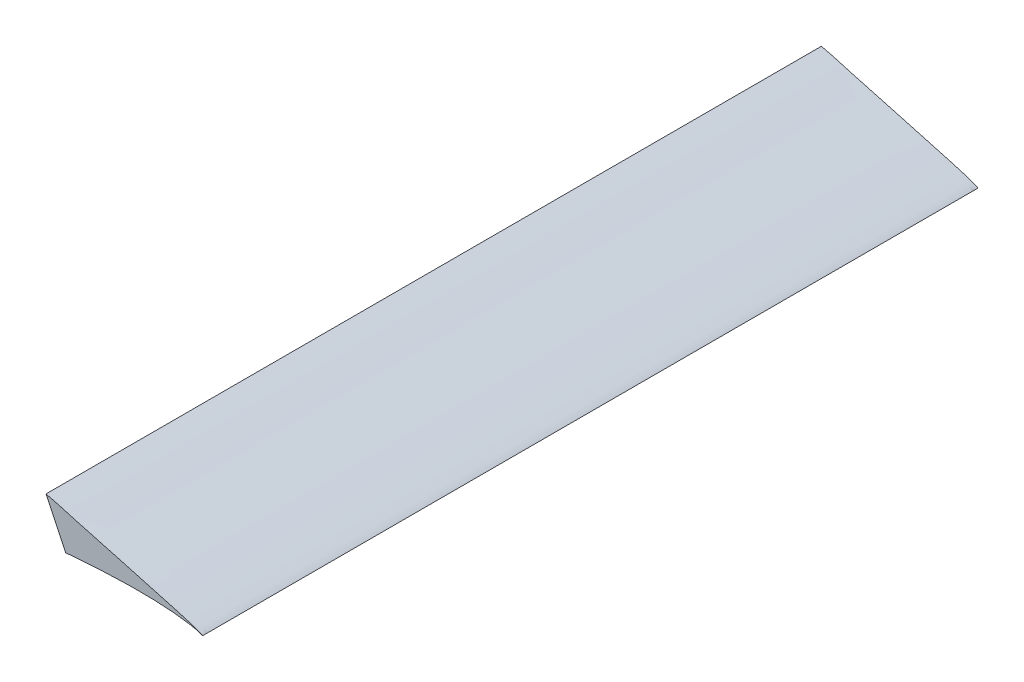
ISO-10303-21;
HEADER;
FILE_DESCRIPTION(('STEP AP214'),'2;1');
FILE_NAME('part.step','',(''),(''),'','','');
FILE_SCHEMA(('AUTOMOTIVE_DESIGN { 1 0 10303 214 1 1 1 1 }'));
ENDSEC;
DATA;
#1=APPLICATION_CONTEXT('core data for automotive mechanical design processes');
#2=APPLICATION_PROTOCOL_DEFINITION('international standard','automotive_design',2000,#1);
#3=PRODUCT_CONTEXT('',#1,'mechanical');
#4=PRODUCT('Part','Part','',(#3));
#5=PRODUCT_RELATED_PRODUCT_CATEGORY('part','',(#4));
#6=PRODUCT_DEFINITION_FORMATION('','',#4);
#7=PRODUCT_DEFINITION_CONTEXT('part definition',#1,'design');
#8=PRODUCT_DEFINITION('design','',#6,#7);
#9=PRODUCT_DEFINITION_SHAPE('','',#8);
#10=(LENGTH_UNIT() NAMED_UNIT(*) SI_UNIT(.MILLI.,.METRE.));
#11=(NAMED_UNIT(*) PLANE_ANGLE_UNIT() SI_UNIT($,.RADIAN.));
#12=(NAMED_UNIT(*) SI_UNIT($,.STERADIAN.) SOLID_ANGLE_UNIT());
#13=UNCERTAINTY_MEASURE_WITH_UNIT(LENGTH_MEASURE(1.E-05),#10,'distance_accuracy_value','');
#14=(GEOMETRIC_REPRESENTATION_CONTEXT(3) GLOBAL_UNCERTAINTY_ASSIGNED_CONTEXT((#13)) GLOBAL_UNIT_ASSIGNED_CONTEXT((#10,
#11,#12)) REPRESENTATION_CONTEXT('',''));
#15=CARTESIAN_POINT('',(0.,0.,0.));
#16=DIRECTION('',(0.,0.,1.));
#17=DIRECTION('',(1.,0.,0.));
#18=AXIS2_PLACEMENT_3D('',#15,#16,#17);
#19=CARTESIAN_POINT('',(252.080803760384,120.091997464376,628.65));
#20=DIRECTION('',(0.902786104260496,0.430089816147927,0.));
#21=DIRECTION('',(-0.430089816147927,0.902786104260496,0.));
#22=AXIS2_PLACEMENT_3D('',#19,#20,#21);
#23=PLANE('',#22);
#24=DIRECTION('',(0.430089816147927,-0.902786104260496,0.));
#25=VECTOR('',#24,1.);
#26=CARTESIAN_POINT('',(252.080803760384,120.091997464376,0.));
#27=LINE('',#26,#25);
#28=CARTESIAN_POINT('',(292.1,36.0891382653728,0.));
#29=VERTEX_POINT('',#28);
#30=CARTESIAN_POINT('',(307.975,2.76649525676335,0.));
#31=VERTEX_POINT('',#30);
#32=EDGE_CURVE('E67',#29,#31,#27,.T.);
#33=ORIENTED_EDGE('',*,*,#32,.T.);
#34=DIRECTION('',(0.,0.,-1.));
#35=VECTOR('',#34,1.);
#36=CARTESIAN_POINT('',(307.975,2.76649525676335,628.65));
#37=LINE('',#36,#35);
#38=CARTESIAN_POINT('',(307.975,2.76649525676335,628.65));
#39=VERTEX_POINT('',#38);
#40=EDGE_CURVE('E11',#39,#31,#37,.T.);
#41=ORIENTED_EDGE('',*,*,#40,.F.);
#42=DIRECTION('',(0.430089816147927,-0.902786104260496,0.));
#43=VECTOR('',#42,1.);
#44=CARTESIAN_POINT('',(252.080803760384,120.091997464376,628.65));
#45=LINE('',#44,#43);
#46=CARTESIAN_POINT('',(292.1,36.0891382653728,628.65));
#47=VERTEX_POINT('',#46);
#48=EDGE_CURVE('E66',#47,#39,#45,.T.);
#49=ORIENTED_EDGE('',*,*,#48,.F.);
#50=DIRECTION('',(0.,0.,-1.));
#51=VECTOR('',#50,1.);
#52=CARTESIAN_POINT('',(292.1,36.0891382653728,628.65));
#53=LINE('',#52,#51);
#54=EDGE_CURVE('E44',#47,#29,#53,.T.);
#55=ORIENTED_EDGE('',*,*,#54,.T.);
#56=EDGE_LOOP('',(#33,#41,#49,#55));
#57=FACE_BOUND('',#56,.T.);
#58=ADVANCED_FACE('F36',(#57),#23,.F.);
#59=CARTESIAN_POINT('',(419.1,0.,628.65));
#60=CARTESIAN_POINT('',(419.135582715604,0.0308317196044877,628.65));
#61=CARTESIAN_POINT('',(415.908005576762,1.68017552922438,628.65));
#62=CARTESIAN_POINT('',(413.243760321431,2.45449325102642,628.65));
#63=CARTESIAN_POINT('',(409.043286393216,3.88399929072975,628.65));
#64=CARTESIAN_POINT('',(404.448084399841,5.26468352260066,628.65));
#65=CARTESIAN_POINT('',(399.073048504437,6.84672085309653,628.65));
#66=CARTESIAN_POINT('',(393.069943473864,8.55383071372093,628.65));
#67=CARTESIAN_POINT('',(386.416537762572,10.4125623702694,628.65));
#68=CARTESIAN_POINT('',(379.149346257583,12.4152401973134,628.65));
#69=CARTESIAN_POINT('',(371.290373604248,14.5663386528226,628.65));
#70=CARTESIAN_POINT('',(362.867607833606,16.8600771410093,628.65));
#71=CARTESIAN_POINT('',(353.911264701423,19.2970964213392,628.65));
#72=CARTESIAN_POINT('',(344.453150457147,21.8730071850554,628.65));
#73=CARTESIAN_POINT('',(334.523432326998,24.5698824655877,628.65));
#74=CARTESIAN_POINT('',(324.169303454509,27.4216021936468,628.65));
#75=CARTESIAN_POINT('',(313.362731470659,30.2499142733887,628.65));
#76=CARTESIAN_POINT('',(302.362905014892,33.694567181203,628.65));
#77=CARTESIAN_POINT('',(290.812066152157,36.3225036594668,628.65));
#78=CARTESIAN_POINT('',(279.147802785444,39.4898304897028,628.65));
#79=CARTESIAN_POINT('',(267.18702760258,42.4092459803584,628.65));
#80=CARTESIAN_POINT('',(255.034690470087,45.1684284186771,628.65));
#81=CARTESIAN_POINT('',(242.721185390446,47.650209376373,628.65));
#82=CARTESIAN_POINT('',(230.296228943543,49.8338945911509,628.65));
#83=CARTESIAN_POINT('',(217.801864374593,51.6800065771285,628.65));
#84=CARTESIAN_POINT('',(205.28400048705,53.175668630729,628.65));
#85=CARTESIAN_POINT('',(192.786307767397,54.3071055161748,628.65));
#86=CARTESIAN_POINT('',(180.35248832563,55.0551537512211,628.65));
#87=CARTESIAN_POINT('',(168.027001927048,55.4190185344547,628.65));
#88=CARTESIAN_POINT('',(155.853682433519,55.4157048874246,628.65));
#89=CARTESIAN_POINT('',(143.874848820048,55.0431886057995,628.65));
#90=CARTESIAN_POINT('',(132.132886757781,54.3128726201629,628.65));
#91=CARTESIAN_POINT('',(120.667074019597,53.2411304735398,628.65));
#92=CARTESIAN_POINT('',(109.522615963792,51.8022144959764,628.65));
#93=CARTESIAN_POINT('',(98.7372141186955,50.0463241889842,628.65));
#94=CARTESIAN_POINT('',(88.3471013961049,48.018984454137,628.65));
#95=CARTESIAN_POINT('',(78.3889033747344,45.7522950434563,628.65));
#96=CARTESIAN_POINT('',(68.8976027410483,43.2760726247493,628.65));
#97=CARTESIAN_POINT('',(59.9067725274482,40.6169839418443,628.65));
#98=CARTESIAN_POINT('',(51.4478081121291,37.8028434738782,628.65));
#99=CARTESIAN_POINT('',(43.5499195166549,34.8620258650089,628.65));
#100=CARTESIAN_POINT('',(36.2412767191211,31.8209315950195,628.65));
#101=CARTESIAN_POINT('',(29.5472205514253,28.7079086552229,628.65));
#102=CARTESIAN_POINT('',(23.4899755011858,25.5532333371454,628.65));
#103=CARTESIAN_POINT('',(18.0911782238622,22.3841442181796,628.65));
#104=CARTESIAN_POINT('',(13.3658843805296,19.2305326996037,628.65));
#105=CARTESIAN_POINT('',(9.3302502078457,16.1138179845186,628.65));
#106=CARTESIAN_POINT('',(5.96985195064272,13.0389997626468,628.65));
#107=CARTESIAN_POINT('',(3.34519775435926,9.93858431084437,628.65));
#108=CARTESIAN_POINT('',(1.18019279694968,6.53570814186339,628.65));
#109=CARTESIAN_POINT('',(0.479614476084666,3.07990840614629,628.65));
#110=CARTESIAN_POINT('',(-0.173094538194013,-0.266173519096999,628.65));
#111=CARTESIAN_POINT('',(0.240253696731487,-3.33294292892219,628.65));
#112=CARTESIAN_POINT('',(1.37823066344816,-6.42381349893486,628.65));
#113=CARTESIAN_POINT('',(3.22917605316422,-9.15021189114401,628.65));
#114=CARTESIAN_POINT('',(5.89603945867697,-11.3206783893859,628.65));
#115=CARTESIAN_POINT('',(9.37076014042797,-12.5914230643237,628.65));
#116=CARTESIAN_POINT('',(13.453435798726,-13.2083059619907,628.65));
#117=CARTESIAN_POINT('',(18.1779423005279,-13.5437135880216,628.65));
#118=CARTESIAN_POINT('',(23.5691170669731,-13.7123319803595,628.65));
#119=CARTESIAN_POINT('',(29.6182619801359,-13.823243232534,628.65));
#120=CARTESIAN_POINT('',(36.3042180587839,-13.6335103430087,628.65));
#121=CARTESIAN_POINT('',(43.6073655350185,-13.7495169210751,628.65));
#122=CARTESIAN_POINT('',(51.4990776759717,-13.5704792834039,628.65));
#123=CARTESIAN_POINT('',(59.9532183473222,-13.4254465725169,628.65));
#124=CARTESIAN_POINT('',(68.9395115321997,-13.2237173628326,628.65));
#125=CARTESIAN_POINT('',(78.4265430004961,-12.9981677083409,628.65));
#126=CARTESIAN_POINT('',(88.3808800346853,-12.7416794666378,628.65));
#127=CARTESIAN_POINT('',(98.7673540895394,-12.4570310641555,628.65));
#128=CARTESIAN_POINT('',(109.54948172432,-12.140459652531,628.65));
#129=CARTESIAN_POINT('',(120.689292624668,-11.7887582713286,628.65));
#130=CARTESIAN_POINT('',(132.147836588957,-11.3961109222143,628.65));
#131=CARTESIAN_POINT('',(143.884459540584,-10.9535138146728,628.65));
#132=CARTESIAN_POINT('',(155.858263106315,-10.4528030476575,628.65));
#133=CARTESIAN_POINT('',(168.027206140478,-9.86999068905553,628.65));
#134=CARTESIAN_POINT('',(180.347887972849,-9.165777546511,628.65));
#135=CARTESIAN_POINT('',(192.776520036076,-8.32898473292583,628.65));
#136=CARTESIAN_POINT('',(205.26997993133,-7.36712520311923,628.65));
#137=CARTESIAN_POINT('',(217.78370517201,-6.28359723526979,628.65));
#138=CARTESIAN_POINT('',(230.27340567155,-5.08810592291552,628.65));
#139=CARTESIAN_POINT('',(242.694431579561,-3.80572861400042,628.65));
#140=CARTESIAN_POINT('',(255.00369846204,-2.48473779902352,628.65));
#141=CARTESIAN_POINT('',(267.1595145786,-1.18392896216685,628.65));
#142=CARTESIAN_POINT('',(279.118910189508,0.0608541103189656,628.65));
#143=CARTESIAN_POINT('',(290.839416131453,1.22547415877869,628.65));
#144=CARTESIAN_POINT('',(302.279388868877,2.28931437619538,628.65));
#145=CARTESIAN_POINT('',(313.398970817434,3.22922123297632,628.65));
#146=CARTESIAN_POINT('',(324.158839538699,4.03315524687126,628.65));
#147=CARTESIAN_POINT('',(334.521417810108,4.68459136287556,628.65));
#148=CARTESIAN_POINT('',(344.449906703923,5.17915941725161,628.65));
#149=CARTESIAN_POINT('',(353.909457193007,5.50145282981024,628.65));
#150=CARTESIAN_POINT('',(362.866468874944,5.68255660990501,628.65));
#151=CARTESIAN_POINT('',(371.289861146006,5.66136185236058,628.65));
#152=CARTESIAN_POINT('',(379.150044793554,5.50730755128629,628.65));
#153=CARTESIAN_POINT('',(386.41801209807,5.19545299038324,628.65));
#154=CARTESIAN_POINT('',(393.072269135646,4.74663009471408,628.65));
#155=CARTESIAN_POINT('',(399.076807101172,4.17945925926168,628.65));
#156=CARTESIAN_POINT('',(404.450455267835,3.48998403896945,628.65));
#157=CARTESIAN_POINT('',(409.051278482858,2.78398441205405,628.65));
#158=CARTESIAN_POINT('',(413.236952463653,1.83700723232058,628.65));
#159=CARTESIAN_POINT('',(415.921101733839,1.37110704301137,628.65));
#160=CARTESIAN_POINT('',(419.065830525278,-0.029607174319721,628.65));
#161=CARTESIAN_POINT('',(419.1,0.,628.65));
#162=B_SPLINE_CURVE_WITH_KNOTS('',3,(#59,#60,#61,#62,#63,#64,#65,#66,#67,#68,#69,#70,#71,#72,
#73,#74,#75,#76,#77,#78,#79,#80,#81,#82,#83,#84,#85,#86,#87,#88,#89,#90,#91,#92,#93,#94,#95,#96,
#97,#98,#99,#100,#101,#102,#103,#104,#105,#106,#107,#108,#109,#110,#111,#112,#113,#114,#115,
#116,#117,#118,#119,#120,#121,#122,#123,#124,#125,#126,#127,#128,#129,#130,#131,#132,#133,#134,
#135,#136,#137,#138,#139,#140,#141,#142,#143,#144,#145,#146,#147,#148,#149,#150,#151,#152,#153,
#154,#155,#156,#157,#158,#159,#160,#161),.UNSPECIFIED.,.T.,.F.,(4,1,1,1,1,1,1,1,1,1,1,1,1,1,1,1,
1,1,1,1,1,1,1,1,1,1,1,1,1,1,1,1,1,1,1,1,1,1,1,1,1,1,1,1,1,1,1,1,1,1,1,1,1,1,1,1,1,1,1,1,1,1,1,1,
1,1,1,1,1,1,1,1,1,1,1,1,1,1,1,1,1,1,1,1,1,1,1,1,1,1,1,1,1,1,1,1,1,1,1,1,4),(0.,
0.00326326473849562,0.00725055778081695,0.0120517866669423,0.0176623330327685,
0.0240683135255837,0.0312496964611172,0.0391846495195136,0.0478476383038653,0.0572106956853794,
0.0672423330052171,0.0779087597757613,0.0891739845115157,0.100998598535301,0.113341295445461,
0.126157183269471,0.139462308480939,0.15301104004999,0.166927614873976,0.181081999654676,
0.195404479567021,0.209838051098696,0.22433260533195,0.238841948726956,0.253325072610518,
0.267739981910177,0.282048685133404,0.296212776873056,0.310196042923521,0.323962314217842,
0.337476234648746,0.350702494836571,0.363610632106416,0.376163958841249,0.388325705275646,
0.400058825783343,0.411327389676265,0.422098222191528,0.43233946020634,0.442020270803025,
0.451113162537921,0.459592207108775,0.467434958693347,0.474622153537792,0.481140130111015,
0.486983093720853,0.492171114209171,0.496782496001346,0.500970225910245,0.505871632390465,
0.508789423353898,0.512670174112342,0.516325667709443,0.520069901737776,0.523879651231969,
0.52796074283848,0.532641784179838,0.53806925539385,0.544264221299989,0.551214848194982,
0.558899644744671,0.567291448215615,0.576362098792024,0.586079537161936,0.59640911206805,
0.607314709370189,0.618758331538551,0.630699137504577,0.643094929182506,0.655903572744297,
0.669079202119925,0.682576600267353,0.696348372587692,0.710348009169474,0.724529115657972,
0.738844326830719,0.753243364933569,0.767678182352391,0.782097111011908,0.796448880119002,
0.810678262943487,0.824728612910585,0.838547558662397,0.852083943216766,0.865287848030887,
0.878111787127333,0.890511304117214,0.902443005266515,0.913865891429004,0.924742045614225,
0.935035830895632,0.944714495449492,0.953747111862331,0.962105881416277,0.969765452086777,
0.97670305026236,0.982898839006144,0.988333205705569,0.992993711919812,0.996866342545812,1.),.UNSPECIFIED.);
#163=DIRECTION('',(0.,0.,-1.));
#164=VECTOR('',#163,1.);
#165=SURFACE_OF_LINEAR_EXTRUSION('',#162,#164);
#166=CARTESIAN_POINT('',(419.1,0.,0.));
#167=CARTESIAN_POINT('',(419.135582715604,0.0308317196044877,0.));
#168=CARTESIAN_POINT('',(415.908005576762,1.68017552922438,0.));
#169=CARTESIAN_POINT('',(413.243760321431,2.45449325102642,0.));
#170=CARTESIAN_POINT('',(409.043286393216,3.88399929072975,0.));
#171=CARTESIAN_POINT('',(404.448084399841,5.26468352260066,0.));
#172=CARTESIAN_POINT('',(399.073048504437,6.84672085309653,0.));
#173=CARTESIAN_POINT('',(393.069943473864,8.55383071372093,0.));
#174=CARTESIAN_POINT('',(386.416537762572,10.4125623702694,0.));
#175=CARTESIAN_POINT('',(379.149346257583,12.4152401973134,0.));
#176=CARTESIAN_POINT('',(371.290373604248,14.5663386528226,0.));
#177=CARTESIAN_POINT('',(362.867607833606,16.8600771410093,0.));
#178=CARTESIAN_POINT('',(353.911264701423,19.2970964213392,0.));
#179=CARTESIAN_POINT('',(344.453150457147,21.8730071850554,0.));
#180=CARTESIAN_POINT('',(334.523432326998,24.5698824655877,0.));
#181=CARTESIAN_POINT('',(324.169303454509,27.4216021936468,0.));
#182=CARTESIAN_POINT('',(313.362731470659,30.2499142733887,0.));
#183=CARTESIAN_POINT('',(302.362905014892,33.694567181203,0.));
#184=CARTESIAN_POINT('',(290.812066152157,36.3225036594668,0.));
#185=CARTESIAN_POINT('',(279.147802785444,39.4898304897028,0.));
#186=CARTESIAN_POINT('',(267.18702760258,42.4092459803584,0.));
#187=CARTESIAN_POINT('',(255.034690470087,45.1684284186771,0.));
#188=CARTESIAN_POINT('',(242.721185390446,47.650209376373,0.));
#189=CARTESIAN_POINT('',(230.296228943543,49.8338945911509,0.));
#190=CARTESIAN_POINT('',(217.801864374593,51.6800065771285,0.));
#191=CARTESIAN_POINT('',(205.28400048705,53.175668630729,0.));
#192=CARTESIAN_POINT('',(192.786307767397,54.3071055161748,0.));
#193=CARTESIAN_POINT('',(180.35248832563,55.0551537512211,0.));
#194=CARTESIAN_POINT('',(168.027001927048,55.4190185344547,0.));
#195=CARTESIAN_POINT('',(155.853682433519,55.4157048874246,0.));
#196=CARTESIAN_POINT('',(143.874848820048,55.0431886057995,0.));
#197=CARTESIAN_POINT('',(132.132886757781,54.3128726201629,0.));
#198=CARTESIAN_POINT('',(120.667074019597,53.2411304735398,0.));
#199=CARTESIAN_POINT('',(109.522615963792,51.8022144959764,0.));
#200=CARTESIAN_POINT('',(98.7372141186955,50.0463241889842,0.));
#201=CARTESIAN_POINT('',(88.3471013961049,48.018984454137,0.));
#202=CARTESIAN_POINT('',(78.3889033747344,45.7522950434563,0.));
#203=CARTESIAN_POINT('',(68.8976027410483,43.2760726247493,0.));
#204=CARTESIAN_POINT('',(59.9067725274482,40.6169839418443,0.));
#205=CARTESIAN_POINT('',(51.4478081121291,37.8028434738782,0.));
#206=CARTESIAN_POINT('',(43.5499195166549,34.8620258650089,0.));
#207=CARTESIAN_POINT('',(36.2412767191211,31.8209315950195,0.));
#208=CARTESIAN_POINT('',(29.5472205514253,28.7079086552229,0.));
#209=CARTESIAN_POINT('',(23.4899755011858,25.5532333371454,0.));
#210=CARTESIAN_POINT('',(18.0911782238622,22.3841442181796,0.));
#211=CARTESIAN_POINT('',(13.3658843805296,19.2305326996037,0.));
#212=CARTESIAN_POINT('',(9.3302502078457,16.1138179845186,0.));
#213=CARTESIAN_POINT('',(5.96985195064272,13.0389997626468,0.));
#214=CARTESIAN_POINT('',(3.34519775435926,9.93858431084437,0.));
#215=CARTESIAN_POINT('',(1.18019279694968,6.53570814186339,0.));
#216=CARTESIAN_POINT('',(0.479614476084666,3.07990840614629,0.));
#217=CARTESIAN_POINT('',(-0.173094538194013,-0.266173519096999,0.));
#218=CARTESIAN_POINT('',(0.240253696731487,-3.33294292892219,0.));
#219=CARTESIAN_POINT('',(1.37823066344816,-6.42381349893486,0.));
#220=CARTESIAN_POINT('',(3.22917605316422,-9.15021189114401,0.));
#221=CARTESIAN_POINT('',(5.89603945867697,-11.3206783893859,0.));
#222=CARTESIAN_POINT('',(9.37076014042797,-12.5914230643237,0.));
#223=CARTESIAN_POINT('',(13.453435798726,-13.2083059619907,0.));
#224=CARTESIAN_POINT('',(18.1779423005279,-13.5437135880216,0.));
#225=CARTESIAN_POINT('',(23.5691170669731,-13.7123319803595,0.));
#226=CARTESIAN_POINT('',(29.6182619801359,-13.823243232534,0.));
#227=CARTESIAN_POINT('',(36.3042180587839,-13.6335103430087,0.));
#228=CARTESIAN_POINT('',(43.6073655350185,-13.7495169210751,0.));
#229=CARTESIAN_POINT('',(51.4990776759717,-13.5704792834039,0.));
#230=CARTESIAN_POINT('',(59.9532183473222,-13.4254465725169,0.));
#231=CARTESIAN_POINT('',(68.9395115321997,-13.2237173628326,0.));
#232=CARTESIAN_POINT('',(78.4265430004961,-12.9981677083409,0.));
#233=CARTESIAN_POINT('',(88.3808800346853,-12.7416794666378,0.));
#234=CARTESIAN_POINT('',(98.7673540895394,-12.4570310641555,0.));
#235=CARTESIAN_POINT('',(109.54948172432,-12.140459652531,0.));
#236=CARTESIAN_POINT('',(120.689292624668,-11.7887582713286,0.));
#237=CARTESIAN_POINT('',(132.147836588957,-11.3961109222143,0.));
#238=CARTESIAN_POINT('',(143.884459540584,-10.9535138146728,0.));
#239=CARTESIAN_POINT('',(155.858263106315,-10.4528030476575,0.));
#240=CARTESIAN_POINT('',(168.027206140478,-9.86999068905553,0.));
#241=CARTESIAN_POINT('',(180.347887972849,-9.165777546511,0.));
#242=CARTESIAN_POINT('',(192.776520036076,-8.32898473292583,0.));
#243=CARTESIAN_POINT('',(205.26997993133,-7.36712520311923,0.));
#244=CARTESIAN_POINT('',(217.78370517201,-6.28359723526979,0.));
#245=CARTESIAN_POINT('',(230.27340567155,-5.08810592291552,0.));
#246=CARTESIAN_POINT('',(242.694431579561,-3.80572861400042,0.));
#247=CARTESIAN_POINT('',(255.00369846204,-2.48473779902352,0.));
#248=CARTESIAN_POINT('',(267.1595145786,-1.18392896216685,0.));
#249=CARTESIAN_POINT('',(279.118910189508,0.0608541103189656,0.));
#250=CARTESIAN_POINT('',(290.839416131453,1.22547415877869,0.));
#251=CARTESIAN_POINT('',(302.279388868877,2.28931437619538,0.));
#252=CARTESIAN_POINT('',(313.398970817434,3.22922123297632,0.));
#253=CARTESIAN_POINT('',(324.158839538699,4.03315524687126,0.));
#254=CARTESIAN_POINT('',(334.521417810108,4.68459136287556,0.));
#255=CARTESIAN_POINT('',(344.449906703923,5.17915941725161,0.));
#256=CARTESIAN_POINT('',(353.909457193007,5.50145282981024,0.));
#257=CARTESIAN_POINT('',(362.866468874944,5.68255660990501,0.));
#258=CARTESIAN_POINT('',(371.289861146006,5.66136185236058,0.));
#259=CARTESIAN_POINT('',(379.150044793554,5.50730755128629,0.));
#260=CARTESIAN_POINT('',(386.41801209807,5.19545299038324,0.));
#261=CARTESIAN_POINT('',(393.072269135646,4.74663009471408,0.));
#262=CARTESIAN_POINT('',(399.076807101172,4.17945925926168,0.));
#263=CARTESIAN_POINT('',(404.450455267835,3.48998403896945,0.));
#264=CARTESIAN_POINT('',(409.051278482858,2.78398441205405,0.));
#265=CARTESIAN_POINT('',(413.236952463653,1.83700723232058,0.));
#266=CARTESIAN_POINT('',(415.921101733839,1.37110704301137,0.));
#267=CARTESIAN_POINT('',(419.065830525278,-0.029607174319721,0.));
#268=CARTESIAN_POINT('',(419.1,0.,0.));
#269=B_SPLINE_CURVE_WITH_KNOTS('',3,(#166,#167,#168,#169,#170,#171,#172,#173,#174,#175,#176,
#177,#178,#179,#180,#181,#182,#183,#184,#185,#186,#187,#188,#189,#190,#191,#192,#193,#194,#195,
#196,#197,#198,#199,#200,#201,#202,#203,#204,#205,#206,#207,#208,#209,#210,#211,#212,#213,#214,
#215,#216,#217,#218,#219,#220,#221,#222,#223,#224,#225,#226,#227,#228,#229,#230,#231,#232,#233,
#234,#235,#236,#237,#238,#239,#240,#241,#242,#243,#244,#245,#246,#247,#248,#249,#250,#251,#252,
#253,#254,#255,#256,#257,#258,#259,#260,#261,#262,#263,#264,#265,#266,#267,#268),.UNSPECIFIED.,
.T.,.F.,(4,1,1,1,1,1,1,1,1,1,1,1,1,1,1,1,1,1,1,1,1,1,1,1,1,1,1,1,1,1,1,1,1,1,1,1,1,1,1,1,1,1,1,
1,1,1,1,1,1,1,1,1,1,1,1,1,1,1,1,1,1,1,1,1,1,1,1,1,1,1,1,1,1,1,1,1,1,1,1,1,1,1,1,1,1,1,1,1,1,1,1,
1,1,1,1,1,1,1,1,1,4),(0.,0.00326326473849562,0.00725055778081695,0.0120517866669423,
0.0176623330327685,0.0240683135255837,0.0312496964611172,0.0391846495195136,0.0478476383038653,
0.0572106956853794,0.0672423330052171,0.0779087597757613,0.0891739845115157,0.100998598535301,
0.113341295445461,0.126157183269471,0.139462308480939,0.15301104004999,0.166927614873976,
0.181081999654676,0.195404479567021,0.209838051098696,0.22433260533195,0.238841948726956,
0.253325072610518,0.267739981910177,0.282048685133404,0.296212776873056,0.310196042923521,
0.323962314217842,0.337476234648746,0.350702494836571,0.363610632106416,0.376163958841249,
0.388325705275646,0.400058825783343,0.411327389676265,0.422098222191528,0.43233946020634,
0.442020270803025,0.451113162537921,0.459592207108775,0.467434958693347,0.474622153537792,
0.481140130111015,0.486983093720853,0.492171114209171,0.496782496001346,0.500970225910245,
0.505871632390465,0.508789423353898,0.512670174112342,0.516325667709443,0.520069901737776,
0.523879651231969,0.52796074283848,0.532641784179838,0.53806925539385,0.544264221299989,
0.551214848194982,0.558899644744671,0.567291448215615,0.576362098792024,0.586079537161936,
0.59640911206805,0.607314709370189,0.618758331538551,0.630699137504577,0.643094929182506,
0.655903572744297,0.669079202119925,0.682576600267353,0.696348372587692,0.710348009169474,
0.724529115657972,0.738844326830719,0.753243364933569,0.767678182352391,0.782097111011908,
0.796448880119002,0.810678262943487,0.824728612910585,0.838547558662397,0.852083943216766,
0.865287848030887,0.878111787127333,0.890511304117214,0.902443005266515,0.913865891429004,
0.924742045614225,0.935035830895632,0.944714495449492,0.953747111862331,0.962105881416277,
0.969765452086777,0.97670305026236,0.982898839006144,0.988333205705569,0.992993711919812,
0.996866342545812,1.),.UNSPECIFIED.);
#270=EDGE_CURVE('E59',#31,#29,#269,.T.);
#271=ORIENTED_EDGE('',*,*,#270,.T.);
#272=ORIENTED_EDGE('',*,*,#54,.F.);
#273=EDGE_CURVE('E51',#39,#47,#162,.T.);
#274=ORIENTED_EDGE('',*,*,#273,.F.);
#275=ORIENTED_EDGE('',*,*,#40,.T.);
#276=EDGE_LOOP('',(#271,#272,#274,#275));
#277=FACE_BOUND('',#276,.T.);
#278=ADVANCED_FACE('F62',(#277),#165,.F.);
#279=CARTESIAN_POINT('',(0.,0.,628.65));
#280=DIRECTION('',(0.,0.,1.));
#281=DIRECTION('',(1.,0.,0.));
#282=AXIS2_PLACEMENT_3D('',#279,#280,#281);
#283=PLANE('',#282);
#284=ORIENTED_EDGE('',*,*,#48,.T.);
#285=ORIENTED_EDGE('',*,*,#273,.T.);
#286=EDGE_LOOP('',(#284,#285));
#287=FACE_BOUND('',#286,.T.);
#288=ADVANCED_FACE('F87',(#287),#283,.T.);
#289=CARTESIAN_POINT('',(0.,0.,0.));
#290=DIRECTION('',(0.,0.,1.));
#291=DIRECTION('',(1.,0.,0.));
#292=AXIS2_PLACEMENT_3D('',#289,#290,#291);
#293=PLANE('',#292);
#294=ORIENTED_EDGE('',*,*,#32,.F.);
#295=ORIENTED_EDGE('',*,*,#270,.F.);
#296=EDGE_LOOP('',(#294,#295));
#297=FACE_BOUND('',#296,.T.);
#298=ADVANCED_FACE('F70',(#297),#293,.F.);
#299=CLOSED_SHELL('',(#58,#278,#288,#298));
#300=MANIFOLD_SOLID_BREP('B2',#299);
#301=ADVANCED_BREP_SHAPE_REPRESENTATION('',(#18,#300),#14);
#302=SHAPE_DEFINITION_REPRESENTATION(#9,#301);
ENDSEC;
END-ISO-10303-21;
